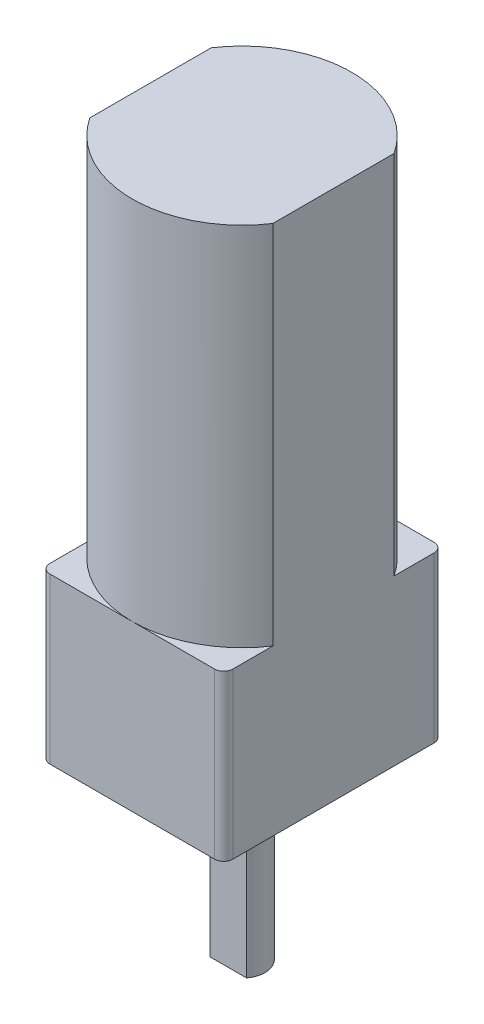
ISO-10303-21;
HEADER;
FILE_DESCRIPTION(('STEP AP214'),'2;1');
FILE_NAME('part.step','',(''),(''),'','','');
FILE_SCHEMA(('AUTOMOTIVE_DESIGN { 1 0 10303 214 1 1 1 1 }'));
ENDSEC;
DATA;
#1=APPLICATION_CONTEXT('core data for automotive mechanical design processes');
#2=APPLICATION_PROTOCOL_DEFINITION('international standard','automotive_design',2000,#1);
#3=PRODUCT_CONTEXT('',#1,'mechanical');
#4=PRODUCT('Part','Part','',(#3));
#5=PRODUCT_RELATED_PRODUCT_CATEGORY('part','',(#4));
#6=PRODUCT_DEFINITION_FORMATION('','',#4);
#7=PRODUCT_DEFINITION_CONTEXT('part definition',#1,'design');
#8=PRODUCT_DEFINITION('design','',#6,#7);
#9=PRODUCT_DEFINITION_SHAPE('','',#8);
#10=(LENGTH_UNIT() NAMED_UNIT(*) SI_UNIT(.MILLI.,.METRE.));
#11=(NAMED_UNIT(*) PLANE_ANGLE_UNIT() SI_UNIT($,.RADIAN.));
#12=(NAMED_UNIT(*) SI_UNIT($,.STERADIAN.) SOLID_ANGLE_UNIT());
#13=UNCERTAINTY_MEASURE_WITH_UNIT(LENGTH_MEASURE(1.E-05),#10,'distance_accuracy_value','');
#14=(GEOMETRIC_REPRESENTATION_CONTEXT(3) GLOBAL_UNCERTAINTY_ASSIGNED_CONTEXT((#13)) GLOBAL_UNIT_ASSIGNED_CONTEXT((#10,
#11,#12)) REPRESENTATION_CONTEXT('',''));
#15=CARTESIAN_POINT('',(0.,0.,0.));
#16=DIRECTION('',(0.,0.,1.));
#17=DIRECTION('',(1.,0.,0.));
#18=AXIS2_PLACEMENT_3D('',#15,#16,#17);
#19=CARTESIAN_POINT('',(0.,0.,0.));
#20=DIRECTION('',(0.,-1.,0.));
#21=DIRECTION('',(0.,0.,-1.));
#22=AXIS2_PLACEMENT_3D('',#19,#20,#21);
#23=PLANE('',#22);
#24=DIRECTION('',(0.,0.,1.));
#25=VECTOR('',#24,1.);
#26=CARTESIAN_POINT('',(0.,0.,0.));
#27=LINE('',#26,#25);
#28=CARTESIAN_POINT('',(0.,0.,9.3166247903554));
#29=VERTEX_POINT('',#28);
#30=CARTESIAN_POINT('',(0.,0.,11.5));
#31=VERTEX_POINT('',#30);
#32=EDGE_CURVE('E231',#29,#31,#27,.T.);
#33=ORIENTED_EDGE('',*,*,#32,.F.);
#34=CARTESIAN_POINT('',(-5.,0.,6.));
#35=DIRECTION('',(0.,1.,0.));
#36=DIRECTION('',(0.,0.,1.));
#37=AXIS2_PLACEMENT_3D('',#34,#35,#36);
#38=CIRCLE('',#37,6.);
#39=CARTESIAN_POINT('',(-5.,0.,12.));
#40=VERTEX_POINT('',#39);
#41=EDGE_CURVE('E52',#29,#40,#38,.F.);
#42=ORIENTED_EDGE('',*,*,#41,.T.);
#43=DIRECTION('',(-1.,0.,0.));
#44=VECTOR('',#43,1.);
#45=CARTESIAN_POINT('',(0.,0.,12.));
#46=LINE('',#45,#44);
#47=CARTESIAN_POINT('',(-0.499999999999999,0.,12.));
#48=VERTEX_POINT('',#47);
#49=EDGE_CURVE('E220',#48,#40,#46,.T.);
#50=ORIENTED_EDGE('',*,*,#49,.F.);
#51=CARTESIAN_POINT('',(-0.499999999999999,0.,11.5));
#52=DIRECTION('',(0.,-1.,0.));
#53=DIRECTION('',(0.,0.,-1.));
#54=AXIS2_PLACEMENT_3D('',#51,#52,#53);
#55=CIRCLE('',#54,0.5);
#56=EDGE_CURVE('E261',#48,#31,#55,.F.);
#57=ORIENTED_EDGE('',*,*,#56,.T.);
#58=EDGE_LOOP('',(#33,#42,#50,#57));
#59=FACE_BOUND('',#58,.T.);
#60=ADVANCED_FACE('F41',(#59),#23,.F.);
#61=CARTESIAN_POINT('',(-9.5,0.,12.));
#62=VERTEX_POINT('',#61);
#63=EDGE_CURVE('E203',#40,#62,#46,.T.);
#64=ORIENTED_EDGE('',*,*,#63,.F.);
#65=CARTESIAN_POINT('',(-10.,0.,9.3166247903554));
#66=VERTEX_POINT('',#65);
#67=EDGE_CURVE('E12',#40,#66,#38,.F.);
#68=ORIENTED_EDGE('',*,*,#67,.T.);
#69=DIRECTION('',(0.,0.,1.));
#70=VECTOR('',#69,1.);
#71=CARTESIAN_POINT('',(-10.,0.,0.));
#72=LINE('',#71,#70);
#73=CARTESIAN_POINT('',(-10.,0.,11.5));
#74=VERTEX_POINT('',#73);
#75=EDGE_CURVE('E223',#66,#74,#72,.T.);
#76=ORIENTED_EDGE('',*,*,#75,.T.);
#77=CARTESIAN_POINT('',(-9.5,0.,11.5));
#78=DIRECTION('',(0.,-1.,0.));
#79=DIRECTION('',(0.,0.,-1.));
#80=AXIS2_PLACEMENT_3D('',#77,#78,#79);
#81=CIRCLE('',#80,0.5);
#82=EDGE_CURVE('E237',#74,#62,#81,.F.);
#83=ORIENTED_EDGE('',*,*,#82,.T.);
#84=EDGE_LOOP('',(#64,#68,#76,#83));
#85=FACE_BOUND('',#84,.T.);
#86=ADVANCED_FACE('F298',(#85),#23,.F.);
#87=CARTESIAN_POINT('',(-10.,0.,0.5));
#88=VERTEX_POINT('',#87);
#89=CARTESIAN_POINT('',(-10.,0.,2.6833752096446));
#90=VERTEX_POINT('',#89);
#91=EDGE_CURVE('E224',#88,#90,#72,.T.);
#92=ORIENTED_EDGE('',*,*,#91,.T.);
#93=CARTESIAN_POINT('',(-5.,0.,6.));
#94=DIRECTION('',(0.,1.,0.));
#95=DIRECTION('',(0.,0.,1.));
#96=AXIS2_PLACEMENT_3D('',#93,#94,#95);
#97=CIRCLE('',#96,6.);
#98=CARTESIAN_POINT('',(-5.,0.,0.));
#99=VERTEX_POINT('',#98);
#100=EDGE_CURVE('E174',#90,#99,#97,.F.);
#101=ORIENTED_EDGE('',*,*,#100,.T.);
#102=DIRECTION('',(-1.,0.,0.));
#103=VECTOR('',#102,1.);
#104=CARTESIAN_POINT('',(0.,0.,0.));
#105=LINE('',#104,#103);
#106=CARTESIAN_POINT('',(-9.5,0.,0.));
#107=VERTEX_POINT('',#106);
#108=EDGE_CURVE('E227',#99,#107,#105,.T.);
#109=ORIENTED_EDGE('',*,*,#108,.T.);
#110=CARTESIAN_POINT('',(-9.5,0.,0.5));
#111=DIRECTION('',(0.,-1.,0.));
#112=DIRECTION('',(0.,0.,-1.));
#113=AXIS2_PLACEMENT_3D('',#110,#111,#112);
#114=CIRCLE('',#113,0.5);
#115=EDGE_CURVE('E258',#107,#88,#114,.F.);
#116=ORIENTED_EDGE('',*,*,#115,.T.);
#117=EDGE_LOOP('',(#92,#101,#109,#116));
#118=FACE_BOUND('',#117,.T.);
#119=ADVANCED_FACE('F291',(#118),#23,.F.);
#120=CARTESIAN_POINT('',(0.,15.,0.));
#121=DIRECTION('',(-1.,0.,0.));
#122=DIRECTION('',(0.,0.,1.));
#123=AXIS2_PLACEMENT_3D('',#120,#121,#122);
#124=PLANE('',#123);
#125=DIRECTION('',(0.,1.,0.));
#126=VECTOR('',#125,1.);
#127=CARTESIAN_POINT('',(0.,15.,0.5));
#128=LINE('',#127,#126);
#129=CARTESIAN_POINT('',(0.,-9.,0.5));
#130=VERTEX_POINT('',#129);
#131=CARTESIAN_POINT('',(0.,0.,0.5));
#132=VERTEX_POINT('',#131);
#133=EDGE_CURVE('E264',#130,#132,#128,.T.);
#134=ORIENTED_EDGE('',*,*,#133,.T.);
#135=CARTESIAN_POINT('',(0.,0.,2.68337520964461));
#136=VERTEX_POINT('',#135);
#137=EDGE_CURVE('E210',#132,#136,#27,.T.);
#138=ORIENTED_EDGE('',*,*,#137,.T.);
#139=DIRECTION('',(0.,-1.,0.));
#140=VECTOR('',#139,1.);
#141=CARTESIAN_POINT('',(0.,20.,2.68337520964461));
#142=LINE('',#141,#140);
#143=CARTESIAN_POINT('',(0.,20.,2.68337520964461));
#144=VERTEX_POINT('',#143);
#145=EDGE_CURVE('E59',#144,#136,#142,.T.);
#146=ORIENTED_EDGE('',*,*,#145,.F.);
#147=DIRECTION('',(0.,0.,-1.));
#148=VECTOR('',#147,1.);
#149=CARTESIAN_POINT('',(0.,20.,0.));
#150=LINE('',#149,#148);
#151=CARTESIAN_POINT('',(0.,20.,9.3166247903554));
#152=VERTEX_POINT('',#151);
#153=EDGE_CURVE('E162',#152,#144,#150,.T.);
#154=ORIENTED_EDGE('',*,*,#153,.F.);
#155=DIRECTION('',(0.,-1.,0.));
#156=VECTOR('',#155,1.);
#157=CARTESIAN_POINT('',(0.,20.,9.3166247903554));
#158=LINE('',#157,#156);
#159=EDGE_CURVE('E152',#152,#29,#158,.T.);
#160=ORIENTED_EDGE('',*,*,#159,.T.);
#161=ORIENTED_EDGE('',*,*,#32,.T.);
#162=DIRECTION('',(0.,1.,0.));
#163=VECTOR('',#162,1.);
#164=CARTESIAN_POINT('',(0.,15.,11.5));
#165=LINE('',#164,#163);
#166=CARTESIAN_POINT('',(0.,-9.,11.5));
#167=VERTEX_POINT('',#166);
#168=EDGE_CURVE('E265',#31,#167,#165,.F.);
#169=ORIENTED_EDGE('',*,*,#168,.T.);
#170=DIRECTION('',(0.,0.,1.));
#171=VECTOR('',#170,1.);
#172=CARTESIAN_POINT('',(0.,-9.,0.));
#173=LINE('',#172,#171);
#174=EDGE_CURVE('E216',#130,#167,#173,.T.);
#175=ORIENTED_EDGE('',*,*,#174,.F.);
#176=EDGE_LOOP('',(#134,#138,#146,#154,#160,#161,#169,#175));
#177=FACE_BOUND('',#176,.T.);
#178=ADVANCED_FACE('F164',(#177),#124,.F.);
#179=CARTESIAN_POINT('',(0.,15.,0.));
#180=DIRECTION('',(0.,0.,1.));
#181=DIRECTION('',(1.,0.,0.));
#182=AXIS2_PLACEMENT_3D('',#179,#180,#181);
#183=PLANE('',#182);
#184=CARTESIAN_POINT('',(-0.5,0.,0.));
#185=VERTEX_POINT('',#184);
#186=EDGE_CURVE('E228',#185,#99,#105,.T.);
#187=ORIENTED_EDGE('',*,*,#186,.F.);
#188=DIRECTION('',(0.,1.,0.));
#189=VECTOR('',#188,1.);
#190=CARTESIAN_POINT('',(-0.5,15.,0.));
#191=LINE('',#190,#189);
#192=CARTESIAN_POINT('',(-0.5,-9.,0.));
#193=VERTEX_POINT('',#192);
#194=EDGE_CURVE('E253',#185,#193,#191,.F.);
#195=ORIENTED_EDGE('',*,*,#194,.T.);
#196=DIRECTION('',(-1.,0.,0.));
#197=VECTOR('',#196,1.);
#198=CARTESIAN_POINT('',(0.,-9.,0.));
#199=LINE('',#198,#197);
#200=CARTESIAN_POINT('',(-9.5,-9.,0.));
#201=VERTEX_POINT('',#200);
#202=EDGE_CURVE('E213',#193,#201,#199,.T.);
#203=ORIENTED_EDGE('',*,*,#202,.T.);
#204=DIRECTION('',(0.,1.,0.));
#205=VECTOR('',#204,1.);
#206=CARTESIAN_POINT('',(-9.5,15.,0.));
#207=LINE('',#206,#205);
#208=EDGE_CURVE('E255',#201,#107,#207,.T.);
#209=ORIENTED_EDGE('',*,*,#208,.T.);
#210=ORIENTED_EDGE('',*,*,#108,.F.);
#211=EDGE_LOOP('',(#187,#195,#203,#209,#210));
#212=FACE_BOUND('',#211,.T.);
#213=ADVANCED_FACE('F279',(#212),#183,.F.);
#214=CARTESIAN_POINT('',(-10.,15.,0.));
#215=DIRECTION('',(1.,0.,0.));
#216=DIRECTION('',(0.,0.,-1.));
#217=AXIS2_PLACEMENT_3D('',#214,#215,#216);
#218=PLANE('',#217);
#219=ORIENTED_EDGE('',*,*,#91,.F.);
#220=DIRECTION('',(0.,1.,0.));
#221=VECTOR('',#220,1.);
#222=CARTESIAN_POINT('',(-10.,15.,0.5));
#223=LINE('',#222,#221);
#224=CARTESIAN_POINT('',(-10.,-9.,0.5));
#225=VERTEX_POINT('',#224);
#226=EDGE_CURVE('E219',#88,#225,#223,.F.);
#227=ORIENTED_EDGE('',*,*,#226,.T.);
#228=DIRECTION('',(0.,0.,1.));
#229=VECTOR('',#228,1.);
#230=CARTESIAN_POINT('',(-10.,-9.,0.));
#231=LINE('',#230,#229);
#232=CARTESIAN_POINT('',(-10.,-9.,11.5));
#233=VERTEX_POINT('',#232);
#234=EDGE_CURVE('E209',#225,#233,#231,.T.);
#235=ORIENTED_EDGE('',*,*,#234,.T.);
#236=DIRECTION('',(0.,1.,0.));
#237=VECTOR('',#236,1.);
#238=CARTESIAN_POINT('',(-10.,15.,11.5));
#239=LINE('',#238,#237);
#240=EDGE_CURVE('E234',#233,#74,#239,.T.);
#241=ORIENTED_EDGE('',*,*,#240,.T.);
#242=ORIENTED_EDGE('',*,*,#75,.F.);
#243=DIRECTION('',(0.,-1.,0.));
#244=VECTOR('',#243,1.);
#245=CARTESIAN_POINT('',(-10.,20.,9.3166247903554));
#246=LINE('',#245,#244);
#247=CARTESIAN_POINT('',(-10.,20.,9.3166247903554));
#248=VERTEX_POINT('',#247);
#249=EDGE_CURVE('E180',#248,#66,#246,.T.);
#250=ORIENTED_EDGE('',*,*,#249,.F.);
#251=DIRECTION('',(0.,0.,1.));
#252=VECTOR('',#251,1.);
#253=CARTESIAN_POINT('',(-10.,20.,0.));
#254=LINE('',#253,#252);
#255=CARTESIAN_POINT('',(-10.,20.,2.6833752096446));
#256=VERTEX_POINT('',#255);
#257=EDGE_CURVE('E172',#256,#248,#254,.T.);
#258=ORIENTED_EDGE('',*,*,#257,.F.);
#259=DIRECTION('',(0.,-1.,0.));
#260=VECTOR('',#259,1.);
#261=CARTESIAN_POINT('',(-10.,20.,2.6833752096446));
#262=LINE('',#261,#260);
#263=EDGE_CURVE('E183',#256,#90,#262,.T.);
#264=ORIENTED_EDGE('',*,*,#263,.T.);
#265=EDGE_LOOP('',(#219,#227,#235,#241,#242,#250,#258,#264));
#266=FACE_BOUND('',#265,.T.);
#267=ADVANCED_FACE('F294',(#266),#218,.F.);
#268=CARTESIAN_POINT('',(0.,15.,12.));
#269=DIRECTION('',(0.,0.,-1.));
#270=DIRECTION('',(-1.,0.,0.));
#271=AXIS2_PLACEMENT_3D('',#268,#269,#270);
#272=PLANE('',#271);
#273=DIRECTION('',(0.,1.,0.));
#274=VECTOR('',#273,1.);
#275=CARTESIAN_POINT('',(-0.499999999999999,15.,12.));
#276=LINE('',#275,#274);
#277=CARTESIAN_POINT('',(-0.499999999999999,-9.,12.));
#278=VERTEX_POINT('',#277);
#279=EDGE_CURVE('E240',#278,#48,#276,.T.);
#280=ORIENTED_EDGE('',*,*,#279,.T.);
#281=ORIENTED_EDGE('',*,*,#49,.T.);
#282=ORIENTED_EDGE('',*,*,#63,.T.);
#283=DIRECTION('',(0.,1.,0.));
#284=VECTOR('',#283,1.);
#285=CARTESIAN_POINT('',(-9.5,15.,12.));
#286=LINE('',#285,#284);
#287=CARTESIAN_POINT('',(-9.5,-9.,12.));
#288=VERTEX_POINT('',#287);
#289=EDGE_CURVE('E243',#62,#288,#286,.F.);
#290=ORIENTED_EDGE('',*,*,#289,.T.);
#291=DIRECTION('',(-1.,0.,0.));
#292=VECTOR('',#291,1.);
#293=CARTESIAN_POINT('',(0.,-9.,12.));
#294=LINE('',#293,#292);
#295=EDGE_CURVE('E206',#278,#288,#294,.T.);
#296=ORIENTED_EDGE('',*,*,#295,.F.);
#297=EDGE_LOOP('',(#280,#281,#282,#290,#296));
#298=FACE_BOUND('',#297,.T.);
#299=ADVANCED_FACE('F302',(#298),#272,.F.);
#300=CARTESIAN_POINT('',(-5.,-19.,6.));
#301=DIRECTION('',(0.,1.,0.));
#302=DIRECTION('',(0.,0.,1.));
#303=AXIS2_PLACEMENT_3D('',#300,#301,#302);
#304=CYLINDRICAL_SURFACE('',#303,1.25);
#305=DIRECTION('',(0.,-1.,0.));
#306=VECTOR('',#305,1.);
#307=CARTESIAN_POINT('',(-4.,-9.8,6.75));
#308=LINE('',#307,#306);
#309=CARTESIAN_POINT('',(-4.,-9.8,6.75));
#310=VERTEX_POINT('',#309);
#311=CARTESIAN_POINT('',(-4.,-19.,6.75));
#312=VERTEX_POINT('',#311);
#313=EDGE_CURVE('E188',#310,#312,#308,.T.);
#314=ORIENTED_EDGE('',*,*,#313,.T.);
#315=CARTESIAN_POINT('',(-5.,-19.,6.));
#316=DIRECTION('',(0.,-1.,0.));
#317=DIRECTION('',(0.,0.,-1.));
#318=AXIS2_PLACEMENT_3D('',#315,#316,#317);
#319=CIRCLE('',#318,1.25);
#320=CARTESIAN_POINT('',(-6.,-19.,6.75));
#321=VERTEX_POINT('',#320);
#322=EDGE_CURVE('E191',#321,#312,#319,.T.);
#323=ORIENTED_EDGE('',*,*,#322,.F.);
#324=DIRECTION('',(0.,-1.,0.));
#325=VECTOR('',#324,1.);
#326=CARTESIAN_POINT('',(-6.,-9.8,6.75));
#327=LINE('',#326,#325);
#328=CARTESIAN_POINT('',(-6.,-9.8,6.75));
#329=VERTEX_POINT('',#328);
#330=EDGE_CURVE('E67',#329,#321,#327,.T.);
#331=ORIENTED_EDGE('',*,*,#330,.F.);
#332=CARTESIAN_POINT('',(-5.,-9.8,6.));
#333=DIRECTION('',(0.,-1.,0.));
#334=DIRECTION('',(0.,0.,-1.));
#335=AXIS2_PLACEMENT_3D('',#332,#333,#334);
#336=CIRCLE('',#335,1.25);
#337=EDGE_CURVE('E196',#329,#310,#336,.T.);
#338=ORIENTED_EDGE('',*,*,#337,.T.);
#339=EDGE_LOOP('',(#314,#323,#331,#338));
#340=FACE_BOUND('',#339,.T.);
#341=ADVANCED_FACE('F335',(#340),#304,.T.);
#342=CARTESIAN_POINT('',(-5.,-19.,6.));
#343=DIRECTION('',(0.,-1.,0.));
#344=DIRECTION('',(0.,0.,-1.));
#345=AXIS2_PLACEMENT_3D('',#342,#343,#344);
#346=PLANE('',#345);
#347=ORIENTED_EDGE('',*,*,#322,.T.);
#348=DIRECTION('',(-1.,0.,0.));
#349=VECTOR('',#348,1.);
#350=CARTESIAN_POINT('',(0.,-19.,6.75));
#351=LINE('',#350,#349);
#352=EDGE_CURVE('E160',#312,#321,#351,.T.);
#353=ORIENTED_EDGE('',*,*,#352,.T.);
#354=EDGE_LOOP('',(#347,#353));
#355=FACE_BOUND('',#354,.T.);
#356=ADVANCED_FACE('F331',(#355),#346,.T.);
#357=ORIENTED_EDGE('',*,*,#186,.T.);
#358=EDGE_CURVE('E50',#99,#136,#97,.F.);
#359=ORIENTED_EDGE('',*,*,#358,.T.);
#360=ORIENTED_EDGE('',*,*,#137,.F.);
#361=CARTESIAN_POINT('',(-0.5,0.,0.5));
#362=DIRECTION('',(0.,-1.,0.));
#363=DIRECTION('',(0.,0.,-1.));
#364=AXIS2_PLACEMENT_3D('',#361,#362,#363);
#365=CIRCLE('',#364,0.5);
#366=EDGE_CURVE('E45',#132,#185,#365,.F.);
#367=ORIENTED_EDGE('',*,*,#366,.T.);
#368=EDGE_LOOP('',(#357,#359,#360,#367));
#369=FACE_BOUND('',#368,.T.);
#370=ADVANCED_FACE('F272',(#369),#23,.F.);
#371=CARTESIAN_POINT('',(0.,-9.,0.));
#372=DIRECTION('',(0.,-1.,0.));
#373=DIRECTION('',(0.,0.,-1.));
#374=AXIS2_PLACEMENT_3D('',#371,#372,#373);
#375=PLANE('',#374);
#376=CARTESIAN_POINT('',(-5.,-9.,6.));
#377=DIRECTION('',(0.,-1.,0.));
#378=DIRECTION('',(0.,0.,-1.));
#379=AXIS2_PLACEMENT_3D('',#376,#377,#378);
#380=CIRCLE('',#379,2.);
#381=CARTESIAN_POINT('',(-5.,-9.,4.));
#382=VERTEX_POINT('',#381);
#383=EDGE_CURVE('E199',#382,#382,#380,.T.);
#384=ORIENTED_EDGE('',*,*,#383,.F.);
#385=EDGE_LOOP('',(#384));
#386=FACE_BOUND('',#385,.T.);
#387=ORIENTED_EDGE('',*,*,#295,.T.);
#388=CARTESIAN_POINT('',(-9.5,-9.,11.5));
#389=DIRECTION('',(0.,-1.,0.));
#390=DIRECTION('',(0.,0.,-1.));
#391=AXIS2_PLACEMENT_3D('',#388,#389,#390);
#392=CIRCLE('',#391,0.5);
#393=EDGE_CURVE('E251',#288,#233,#392,.T.);
#394=ORIENTED_EDGE('',*,*,#393,.T.);
#395=ORIENTED_EDGE('',*,*,#234,.F.);
#396=CARTESIAN_POINT('',(-9.5,-9.,0.5));
#397=DIRECTION('',(0.,-1.,0.));
#398=DIRECTION('',(0.,0.,-1.));
#399=AXIS2_PLACEMENT_3D('',#396,#397,#398);
#400=CIRCLE('',#399,0.5);
#401=EDGE_CURVE('E249',#225,#201,#400,.T.);
#402=ORIENTED_EDGE('',*,*,#401,.T.);
#403=ORIENTED_EDGE('',*,*,#202,.F.);
#404=CARTESIAN_POINT('',(-0.5,-9.,0.5));
#405=DIRECTION('',(0.,-1.,0.));
#406=DIRECTION('',(0.,0.,-1.));
#407=AXIS2_PLACEMENT_3D('',#404,#405,#406);
#408=CIRCLE('',#407,0.5);
#409=EDGE_CURVE('E245',#193,#130,#408,.T.);
#410=ORIENTED_EDGE('',*,*,#409,.T.);
#411=ORIENTED_EDGE('',*,*,#174,.T.);
#412=CARTESIAN_POINT('',(-0.499999999999999,-9.,11.5));
#413=DIRECTION('',(0.,-1.,0.));
#414=DIRECTION('',(0.,0.,-1.));
#415=AXIS2_PLACEMENT_3D('',#412,#413,#414);
#416=CIRCLE('',#415,0.5);
#417=EDGE_CURVE('E247',#167,#278,#416,.T.);
#418=ORIENTED_EDGE('',*,*,#417,.T.);
#419=EDGE_LOOP('',(#387,#394,#395,#402,#403,#410,#411,#418));
#420=FACE_BOUND('',#419,.T.);
#421=ADVANCED_FACE('F283',(#386,#420),#375,.T.);
#422=CARTESIAN_POINT('',(-9.5,15.,11.5));
#423=DIRECTION('',(0.,1.,0.));
#424=DIRECTION('',(0.,0.,1.));
#425=AXIS2_PLACEMENT_3D('',#422,#423,#424);
#426=CYLINDRICAL_SURFACE('',#425,0.5);
#427=ORIENTED_EDGE('',*,*,#393,.F.);
#428=ORIENTED_EDGE('',*,*,#289,.F.);
#429=ORIENTED_EDGE('',*,*,#82,.F.);
#430=ORIENTED_EDGE('',*,*,#240,.F.);
#431=EDGE_LOOP('',(#427,#428,#429,#430));
#432=FACE_BOUND('',#431,.T.);
#433=ADVANCED_FACE('F312',(#432),#426,.T.);
#434=CARTESIAN_POINT('',(-9.5,15.,0.5));
#435=DIRECTION('',(0.,1.,0.));
#436=DIRECTION('',(0.,0.,1.));
#437=AXIS2_PLACEMENT_3D('',#434,#435,#436);
#438=CYLINDRICAL_SURFACE('',#437,0.5);
#439=ORIENTED_EDGE('',*,*,#401,.F.);
#440=ORIENTED_EDGE('',*,*,#226,.F.);
#441=ORIENTED_EDGE('',*,*,#115,.F.);
#442=ORIENTED_EDGE('',*,*,#208,.F.);
#443=EDGE_LOOP('',(#439,#440,#441,#442));
#444=FACE_BOUND('',#443,.T.);
#445=ADVANCED_FACE('F288',(#444),#438,.T.);
#446=CARTESIAN_POINT('',(-0.499999999999999,15.,11.5));
#447=DIRECTION('',(0.,1.,0.));
#448=DIRECTION('',(0.,0.,1.));
#449=AXIS2_PLACEMENT_3D('',#446,#447,#448);
#450=CYLINDRICAL_SURFACE('',#449,0.5);
#451=ORIENTED_EDGE('',*,*,#417,.F.);
#452=ORIENTED_EDGE('',*,*,#168,.F.);
#453=ORIENTED_EDGE('',*,*,#56,.F.);
#454=ORIENTED_EDGE('',*,*,#279,.F.);
#455=EDGE_LOOP('',(#451,#452,#453,#454));
#456=FACE_BOUND('',#455,.T.);
#457=ADVANCED_FACE('F309',(#456),#450,.T.);
#458=CARTESIAN_POINT('',(-0.5,15.,0.5));
#459=DIRECTION('',(0.,1.,0.));
#460=DIRECTION('',(0.,0.,1.));
#461=AXIS2_PLACEMENT_3D('',#458,#459,#460);
#462=CYLINDRICAL_SURFACE('',#461,0.5);
#463=ORIENTED_EDGE('',*,*,#409,.F.);
#464=ORIENTED_EDGE('',*,*,#194,.F.);
#465=ORIENTED_EDGE('',*,*,#366,.F.);
#466=ORIENTED_EDGE('',*,*,#133,.F.);
#467=EDGE_LOOP('',(#463,#464,#465,#466));
#468=FACE_BOUND('',#467,.T.);
#469=ADVANCED_FACE('F43',(#468),#462,.T.);
#470=CARTESIAN_POINT('',(-5.,-9.8,6.));
#471=DIRECTION('',(0.,-1.,0.));
#472=DIRECTION('',(0.,0.,-1.));
#473=AXIS2_PLACEMENT_3D('',#470,#471,#472);
#474=PLANE('',#473);
#475=CARTESIAN_POINT('',(-5.,-9.8,6.));
#476=DIRECTION('',(0.,-1.,0.));
#477=DIRECTION('',(0.,0.,-1.));
#478=AXIS2_PLACEMENT_3D('',#475,#476,#477);
#479=CIRCLE('',#478,2.);
#480=CARTESIAN_POINT('',(-5.,-9.8,4.));
#481=VERTEX_POINT('',#480);
#482=EDGE_CURVE('E200',#481,#481,#479,.T.);
#483=ORIENTED_EDGE('',*,*,#482,.T.);
#484=EDGE_LOOP('',(#483));
#485=FACE_BOUND('',#484,.T.);
#486=ORIENTED_EDGE('',*,*,#337,.F.);
#487=DIRECTION('',(-1.,0.,0.));
#488=VECTOR('',#487,1.);
#489=CARTESIAN_POINT('',(0.,-9.8,6.75));
#490=LINE('',#489,#488);
#491=EDGE_CURVE('E186',#310,#329,#490,.T.);
#492=ORIENTED_EDGE('',*,*,#491,.F.);
#493=EDGE_LOOP('',(#486,#492));
#494=FACE_BOUND('',#493,.T.);
#495=ADVANCED_FACE('F358',(#485,#494),#474,.T.);
#496=CARTESIAN_POINT('',(-5.,-9.8,6.));
#497=DIRECTION('',(0.,1.,0.));
#498=DIRECTION('',(0.,0.,1.));
#499=AXIS2_PLACEMENT_3D('',#496,#497,#498);
#500=CYLINDRICAL_SURFACE('',#499,2.);
#501=ORIENTED_EDGE('',*,*,#482,.F.);
#502=EDGE_LOOP('',(#501));
#503=FACE_BOUND('',#502,.T.);
#504=ORIENTED_EDGE('',*,*,#383,.T.);
#505=EDGE_LOOP('',(#504));
#506=FACE_BOUND('',#505,.T.);
#507=ADVANCED_FACE('F361',(#503,#506),#500,.T.);
#508=CARTESIAN_POINT('',(0.,-9.8,6.75));
#509=DIRECTION('',(0.,0.,1.));
#510=DIRECTION('',(1.,0.,0.));
#511=AXIS2_PLACEMENT_3D('',#508,#509,#510);
#512=PLANE('',#511);
#513=ORIENTED_EDGE('',*,*,#352,.F.);
#514=ORIENTED_EDGE('',*,*,#313,.F.);
#515=ORIENTED_EDGE('',*,*,#491,.T.);
#516=ORIENTED_EDGE('',*,*,#330,.T.);
#517=EDGE_LOOP('',(#513,#514,#515,#516));
#518=FACE_BOUND('',#517,.T.);
#519=ADVANCED_FACE('F364',(#518),#512,.T.);
#520=CARTESIAN_POINT('',(-5.,20.,6.));
#521=DIRECTION('',(0.,-1.,0.));
#522=DIRECTION('',(0.,0.,-1.));
#523=AXIS2_PLACEMENT_3D('',#520,#521,#522);
#524=CYLINDRICAL_SURFACE('',#523,6.);
#525=ORIENTED_EDGE('',*,*,#41,.F.);
#526=ORIENTED_EDGE('',*,*,#159,.F.);
#527=CARTESIAN_POINT('',(-5.,20.,6.));
#528=DIRECTION('',(0.,1.,0.));
#529=DIRECTION('',(0.,0.,1.));
#530=AXIS2_PLACEMENT_3D('',#527,#528,#529);
#531=CIRCLE('',#530,6.);
#532=EDGE_CURVE('E156',#152,#248,#531,.F.);
#533=ORIENTED_EDGE('',*,*,#532,.T.);
#534=ORIENTED_EDGE('',*,*,#249,.T.);
#535=ORIENTED_EDGE('',*,*,#67,.F.);
#536=EDGE_LOOP('',(#525,#526,#533,#534,#535));
#537=FACE_BOUND('',#536,.T.);
#538=ADVANCED_FACE('F154',(#537),#524,.T.);
#539=CARTESIAN_POINT('',(-5.,20.,6.));
#540=DIRECTION('',(0.,-1.,0.));
#541=DIRECTION('',(0.,0.,-1.));
#542=AXIS2_PLACEMENT_3D('',#539,#540,#541);
#543=CYLINDRICAL_SURFACE('',#542,6.);
#544=ORIENTED_EDGE('',*,*,#100,.F.);
#545=ORIENTED_EDGE('',*,*,#263,.F.);
#546=CARTESIAN_POINT('',(-5.,20.,6.));
#547=DIRECTION('',(0.,1.,0.));
#548=DIRECTION('',(0.,0.,1.));
#549=AXIS2_PLACEMENT_3D('',#546,#547,#548);
#550=CIRCLE('',#549,6.);
#551=EDGE_CURVE('E168',#256,#144,#550,.F.);
#552=ORIENTED_EDGE('',*,*,#551,.T.);
#553=ORIENTED_EDGE('',*,*,#145,.T.);
#554=ORIENTED_EDGE('',*,*,#358,.F.);
#555=EDGE_LOOP('',(#544,#545,#552,#553,#554));
#556=FACE_BOUND('',#555,.T.);
#557=ADVANCED_FACE('F292',(#556),#543,.T.);
#558=CARTESIAN_POINT('',(0.,20.,0.));
#559=DIRECTION('',(0.,1.,0.));
#560=DIRECTION('',(0.,0.,1.));
#561=AXIS2_PLACEMENT_3D('',#558,#559,#560);
#562=PLANE('',#561);
#563=ORIENTED_EDGE('',*,*,#532,.F.);
#564=ORIENTED_EDGE('',*,*,#153,.T.);
#565=ORIENTED_EDGE('',*,*,#551,.F.);
#566=ORIENTED_EDGE('',*,*,#257,.T.);
#567=EDGE_LOOP('',(#563,#564,#565,#566));
#568=FACE_BOUND('',#567,.T.);
#569=ADVANCED_FACE('F170',(#568),#562,.T.);
#570=CLOSED_SHELL('',(#60,#86,#119,#178,#213,#267,#299,#341,#356,#370,#421,#433,#445,#457,#469,
#495,#507,#519,#538,#557,#569));
#571=MANIFOLD_SOLID_BREP('B2',#570);
#572=ADVANCED_BREP_SHAPE_REPRESENTATION('',(#18,#571),#14);
#573=SHAPE_DEFINITION_REPRESENTATION(#9,#572);
ENDSEC;
END-ISO-10303-21;
